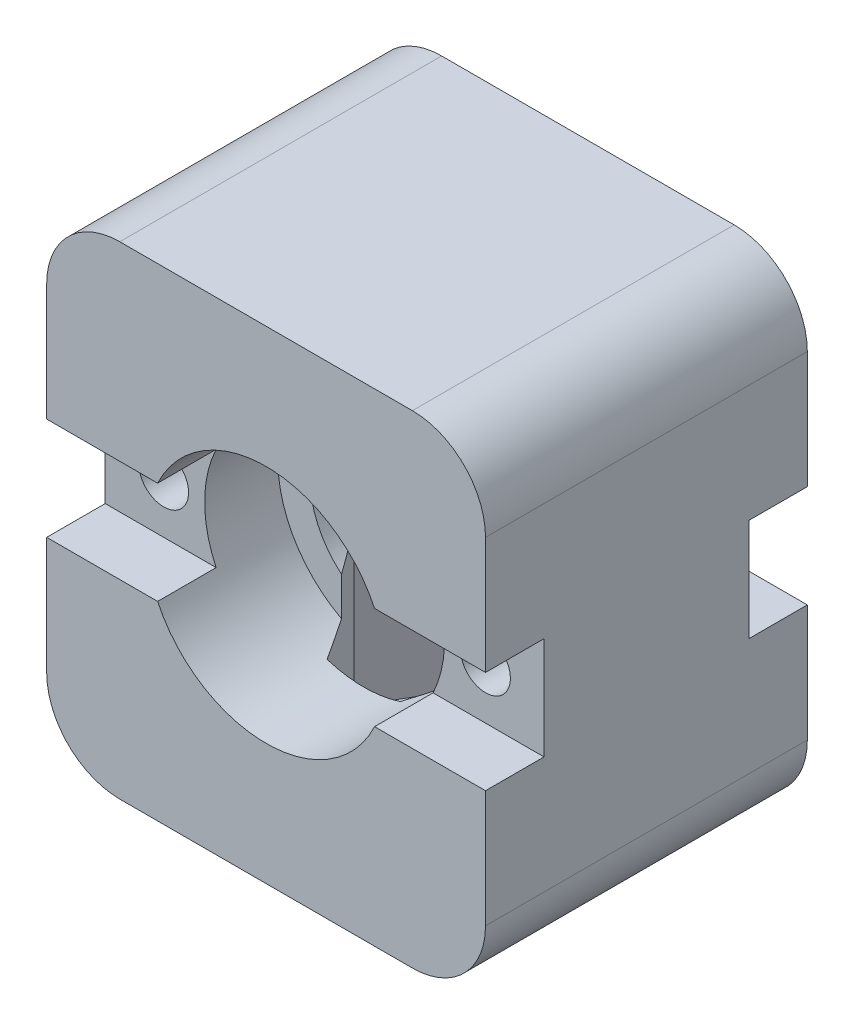
ISO-10303-21;
HEADER;
FILE_DESCRIPTION(('STEP AP214'),'2;1');
FILE_NAME('part.step','',(''),(''),'','','');
FILE_SCHEMA(('AUTOMOTIVE_DESIGN { 1 0 10303 214 1 1 1 1 }'));
ENDSEC;
DATA;
#1=APPLICATION_CONTEXT('core data for automotive mechanical design processes');
#2=APPLICATION_PROTOCOL_DEFINITION('international standard','automotive_design',2000,#1);
#3=PRODUCT_CONTEXT('',#1,'mechanical');
#4=PRODUCT('Part','Part','',(#3));
#5=PRODUCT_RELATED_PRODUCT_CATEGORY('part','',(#4));
#6=PRODUCT_DEFINITION_FORMATION('','',#4);
#7=PRODUCT_DEFINITION_CONTEXT('part definition',#1,'design');
#8=PRODUCT_DEFINITION('design','',#6,#7);
#9=PRODUCT_DEFINITION_SHAPE('','',#8);
#10=(LENGTH_UNIT() NAMED_UNIT(*) SI_UNIT(.MILLI.,.METRE.));
#11=(NAMED_UNIT(*) PLANE_ANGLE_UNIT() SI_UNIT($,.RADIAN.));
#12=(NAMED_UNIT(*) SI_UNIT($,.STERADIAN.) SOLID_ANGLE_UNIT());
#13=UNCERTAINTY_MEASURE_WITH_UNIT(LENGTH_MEASURE(1.E-05),#10,'distance_accuracy_value','');
#14=(GEOMETRIC_REPRESENTATION_CONTEXT(3) GLOBAL_UNCERTAINTY_ASSIGNED_CONTEXT((#13)) GLOBAL_UNIT_ASSIGNED_CONTEXT((#10,
#11,#12)) REPRESENTATION_CONTEXT('',''));
#15=CARTESIAN_POINT('',(0.,0.,0.));
#16=DIRECTION('',(0.,0.,1.));
#17=DIRECTION('',(1.,0.,0.));
#18=AXIS2_PLACEMENT_3D('',#15,#16,#17);
#19=CARTESIAN_POINT('',(11.,0.,22.));
#20=DIRECTION('',(0.,0.,-1.));
#21=DIRECTION('',(-1.,0.,0.));
#22=AXIS2_PLACEMENT_3D('',#19,#20,#21);
#23=CYLINDRICAL_SURFACE('',#22,1.7);
#24=CARTESIAN_POINT('',(11.,0.,7.));
#25=DIRECTION('',(0.,0.,1.));
#26=DIRECTION('',(1.,0.,0.));
#27=AXIS2_PLACEMENT_3D('',#24,#25,#26);
#28=CIRCLE('',#27,1.7);
#29=CARTESIAN_POINT('',(12.7,0.,7.));
#30=VERTEX_POINT('',#29);
#31=EDGE_CURVE('E486',#30,#30,#28,.F.);
#32=ORIENTED_EDGE('',*,*,#31,.F.);
#33=EDGE_LOOP('',(#32));
#34=FACE_BOUND('',#33,.T.);
#35=CARTESIAN_POINT('',(11.,0.,-7.));
#36=DIRECTION('',(0.,0.,-1.));
#37=DIRECTION('',(-1.,0.,0.));
#38=AXIS2_PLACEMENT_3D('',#35,#36,#37);
#39=CIRCLE('',#38,1.7);
#40=CARTESIAN_POINT('',(9.3,0.,-7.));
#41=VERTEX_POINT('',#40);
#42=EDGE_CURVE('E280',#41,#41,#39,.F.);
#43=ORIENTED_EDGE('',*,*,#42,.F.);
#44=EDGE_LOOP('',(#43));
#45=FACE_BOUND('',#44,.T.);
#46=ADVANCED_FACE('F36',(#34,#45),#23,.F.);
#47=CARTESIAN_POINT('',(-11.,0.,22.));
#48=DIRECTION('',(0.,0.,-1.));
#49=DIRECTION('',(-1.,0.,0.));
#50=AXIS2_PLACEMENT_3D('',#47,#48,#49);
#51=CYLINDRICAL_SURFACE('',#50,1.7);
#52=CARTESIAN_POINT('',(-11.,0.,7.));
#53=DIRECTION('',(0.,0.,1.));
#54=DIRECTION('',(1.,0.,0.));
#55=AXIS2_PLACEMENT_3D('',#52,#53,#54);
#56=CIRCLE('',#55,1.7);
#57=CARTESIAN_POINT('',(-9.3,0.,7.));
#58=VERTEX_POINT('',#57);
#59=EDGE_CURVE('E483',#58,#58,#56,.F.);
#60=ORIENTED_EDGE('',*,*,#59,.F.);
#61=EDGE_LOOP('',(#60));
#62=FACE_BOUND('',#61,.T.);
#63=CARTESIAN_POINT('',(-11.,0.,-7.));
#64=DIRECTION('',(0.,0.,-1.));
#65=DIRECTION('',(-1.,0.,0.));
#66=AXIS2_PLACEMENT_3D('',#63,#64,#65);
#67=CIRCLE('',#66,1.7);
#68=CARTESIAN_POINT('',(-12.7,0.,-7.));
#69=VERTEX_POINT('',#68);
#70=EDGE_CURVE('E396',#69,#69,#67,.F.);
#71=ORIENTED_EDGE('',*,*,#70,.F.);
#72=EDGE_LOOP('',(#71));
#73=FACE_BOUND('',#72,.T.);
#74=ADVANCED_FACE('F619',(#62,#73),#51,.F.);
#75=CARTESIAN_POINT('',(-15.,-11.5,-11.));
#76=DIRECTION('',(-1.,0.,0.));
#77=DIRECTION('',(0.,0.,1.));
#78=AXIS2_PLACEMENT_3D('',#75,#76,#77);
#79=PLANE('',#78);
#80=DIRECTION('',(0.,-1.,0.));
#81=VECTOR('',#80,1.);
#82=CARTESIAN_POINT('',(-15.,-11.5,-7.));
#83=LINE('',#82,#81);
#84=CARTESIAN_POINT('',(-15.,3.5,-7.));
#85=VERTEX_POINT('',#84);
#86=CARTESIAN_POINT('',(-15.,-3.5,-7.));
#87=VERTEX_POINT('',#86);
#88=EDGE_CURVE('E393',#85,#87,#83,.T.);
#89=ORIENTED_EDGE('',*,*,#88,.T.);
#90=DIRECTION('',(0.,0.,-1.));
#91=VECTOR('',#90,1.);
#92=CARTESIAN_POINT('',(-15.,-3.5,-11.));
#93=LINE('',#92,#91);
#94=CARTESIAN_POINT('',(-15.,-3.5,-11.));
#95=VERTEX_POINT('',#94);
#96=EDGE_CURVE('E405',#87,#95,#93,.T.);
#97=ORIENTED_EDGE('',*,*,#96,.T.);
#98=DIRECTION('',(0.,-1.,0.));
#99=VECTOR('',#98,1.);
#100=CARTESIAN_POINT('',(-15.,1.5,-11.));
#101=LINE('',#100,#99);
#102=CARTESIAN_POINT('',(-15.,-11.5,-11.));
#103=VERTEX_POINT('',#102);
#104=EDGE_CURVE('E303',#95,#103,#101,.T.);
#105=ORIENTED_EDGE('',*,*,#104,.T.);
#106=DIRECTION('',(0.,0.,1.));
#107=VECTOR('',#106,1.);
#108=CARTESIAN_POINT('',(-15.,-11.5,-11.));
#109=LINE('',#108,#107);
#110=CARTESIAN_POINT('',(-15.,-11.5,11.));
#111=VERTEX_POINT('',#110);
#112=EDGE_CURVE('E308',#103,#111,#109,.T.);
#113=ORIENTED_EDGE('',*,*,#112,.T.);
#114=DIRECTION('',(0.,-1.,0.));
#115=VECTOR('',#114,1.);
#116=CARTESIAN_POINT('',(-15.,1.5,11.));
#117=LINE('',#116,#115);
#118=CARTESIAN_POINT('',(-15.,-3.5,11.));
#119=VERTEX_POINT('',#118);
#120=EDGE_CURVE('E530',#119,#111,#117,.T.);
#121=ORIENTED_EDGE('',*,*,#120,.F.);
#122=DIRECTION('',(0.,0.,1.));
#123=VECTOR('',#122,1.);
#124=CARTESIAN_POINT('',(-15.,-3.5,-11.));
#125=LINE('',#124,#123);
#126=CARTESIAN_POINT('',(-15.,-3.5,7.));
#127=VERTEX_POINT('',#126);
#128=EDGE_CURVE('E497',#127,#119,#125,.T.);
#129=ORIENTED_EDGE('',*,*,#128,.F.);
#130=DIRECTION('',(0.,1.,0.));
#131=VECTOR('',#130,1.);
#132=CARTESIAN_POINT('',(-15.,-11.5,7.));
#133=LINE('',#132,#131);
#134=CARTESIAN_POINT('',(-15.,3.5,7.));
#135=VERTEX_POINT('',#134);
#136=EDGE_CURVE('E492',#127,#135,#133,.T.);
#137=ORIENTED_EDGE('',*,*,#136,.T.);
#138=DIRECTION('',(0.,0.,-1.));
#139=VECTOR('',#138,1.);
#140=CARTESIAN_POINT('',(-15.,3.5,-11.));
#141=LINE('',#140,#139);
#142=CARTESIAN_POINT('',(-15.,3.5,11.));
#143=VERTEX_POINT('',#142);
#144=EDGE_CURVE('E501',#143,#135,#141,.T.);
#145=ORIENTED_EDGE('',*,*,#144,.F.);
#146=CARTESIAN_POINT('',(-15.,11.5,11.));
#147=VERTEX_POINT('',#146);
#148=EDGE_CURVE('E531',#147,#143,#117,.T.);
#149=ORIENTED_EDGE('',*,*,#148,.F.);
#150=DIRECTION('',(0.,0.,1.));
#151=VECTOR('',#150,1.);
#152=CARTESIAN_POINT('',(-15.,11.5,-11.));
#153=LINE('',#152,#151);
#154=CARTESIAN_POINT('',(-15.,11.5,-11.));
#155=VERTEX_POINT('',#154);
#156=EDGE_CURVE('E312',#155,#147,#153,.T.);
#157=ORIENTED_EDGE('',*,*,#156,.F.);
#158=CARTESIAN_POINT('',(-15.,3.5,-11.));
#159=VERTEX_POINT('',#158);
#160=EDGE_CURVE('E304',#155,#159,#101,.T.);
#161=ORIENTED_EDGE('',*,*,#160,.T.);
#162=DIRECTION('',(0.,0.,1.));
#163=VECTOR('',#162,1.);
#164=CARTESIAN_POINT('',(-15.,3.5,-11.));
#165=LINE('',#164,#163);
#166=EDGE_CURVE('E279',#159,#85,#165,.T.);
#167=ORIENTED_EDGE('',*,*,#166,.T.);
#168=EDGE_LOOP('',(#89,#97,#105,#113,#121,#129,#137,#145,#149,#157,#161,#167));
#169=FACE_BOUND('',#168,.T.);
#170=ADVANCED_FACE('F552',(#169),#79,.T.);
#171=CARTESIAN_POINT('',(15.,1.50000000000001,-11.));
#172=DIRECTION('',(1.,0.,0.));
#173=DIRECTION('',(0.,1.,0.));
#174=AXIS2_PLACEMENT_3D('',#171,#172,#173);
#175=PLANE('',#174);
#176=DIRECTION('',(0.,1.,0.));
#177=VECTOR('',#176,1.);
#178=CARTESIAN_POINT('',(15.,-11.5,-11.));
#179=LINE('',#178,#177);
#180=CARTESIAN_POINT('',(15.,-11.5,-11.));
#181=VERTEX_POINT('',#180);
#182=CARTESIAN_POINT('',(15.,-3.5,-11.));
#183=VERTEX_POINT('',#182);
#184=EDGE_CURVE('E288',#181,#183,#179,.T.);
#185=ORIENTED_EDGE('',*,*,#184,.T.);
#186=DIRECTION('',(0.,0.,1.));
#187=VECTOR('',#186,1.);
#188=CARTESIAN_POINT('',(15.,-3.5,-11.));
#189=LINE('',#188,#187);
#190=CARTESIAN_POINT('',(15.,-3.5,-7.));
#191=VERTEX_POINT('',#190);
#192=EDGE_CURVE('E403',#183,#191,#189,.T.);
#193=ORIENTED_EDGE('',*,*,#192,.T.);
#194=DIRECTION('',(0.,1.,0.));
#195=VECTOR('',#194,1.);
#196=CARTESIAN_POINT('',(15.,1.50000000000001,-7.));
#197=LINE('',#196,#195);
#198=CARTESIAN_POINT('',(15.,3.5,-7.));
#199=VERTEX_POINT('',#198);
#200=EDGE_CURVE('E278',#191,#199,#197,.T.);
#201=ORIENTED_EDGE('',*,*,#200,.T.);
#202=DIRECTION('',(0.,0.,-1.));
#203=VECTOR('',#202,1.);
#204=CARTESIAN_POINT('',(15.,3.5,-11.));
#205=LINE('',#204,#203);
#206=CARTESIAN_POINT('',(15.,3.5,-11.));
#207=VERTEX_POINT('',#206);
#208=EDGE_CURVE('E260',#199,#207,#205,.T.);
#209=ORIENTED_EDGE('',*,*,#208,.T.);
#210=CARTESIAN_POINT('',(15.,11.5,-11.));
#211=VERTEX_POINT('',#210);
#212=EDGE_CURVE('E275',#207,#211,#179,.T.);
#213=ORIENTED_EDGE('',*,*,#212,.T.);
#214=DIRECTION('',(0.,0.,1.));
#215=VECTOR('',#214,1.);
#216=CARTESIAN_POINT('',(15.,11.5,-11.));
#217=LINE('',#216,#215);
#218=CARTESIAN_POINT('',(15.,11.5,11.));
#219=VERTEX_POINT('',#218);
#220=EDGE_CURVE('E318',#211,#219,#217,.T.);
#221=ORIENTED_EDGE('',*,*,#220,.T.);
#222=DIRECTION('',(0.,1.,0.));
#223=VECTOR('',#222,1.);
#224=CARTESIAN_POINT('',(15.,-11.5,11.));
#225=LINE('',#224,#223);
#226=CARTESIAN_POINT('',(15.,3.5,11.));
#227=VERTEX_POINT('',#226);
#228=EDGE_CURVE('E517',#227,#219,#225,.T.);
#229=ORIENTED_EDGE('',*,*,#228,.F.);
#230=DIRECTION('',(0.,0.,1.));
#231=VECTOR('',#230,1.);
#232=CARTESIAN_POINT('',(15.,3.5,-11.));
#233=LINE('',#232,#231);
#234=CARTESIAN_POINT('',(15.,3.5,7.));
#235=VERTEX_POINT('',#234);
#236=EDGE_CURVE('E499',#235,#227,#233,.T.);
#237=ORIENTED_EDGE('',*,*,#236,.F.);
#238=DIRECTION('',(0.,-1.,0.));
#239=VECTOR('',#238,1.);
#240=CARTESIAN_POINT('',(15.,1.50000000000001,7.));
#241=LINE('',#240,#239);
#242=CARTESIAN_POINT('',(15.,-3.5,7.));
#243=VERTEX_POINT('',#242);
#244=EDGE_CURVE('E489',#235,#243,#241,.T.);
#245=ORIENTED_EDGE('',*,*,#244,.T.);
#246=DIRECTION('',(0.,0.,-1.));
#247=VECTOR('',#246,1.);
#248=CARTESIAN_POINT('',(15.,-3.5,-11.));
#249=LINE('',#248,#247);
#250=CARTESIAN_POINT('',(15.,-3.5,11.));
#251=VERTEX_POINT('',#250);
#252=EDGE_CURVE('E495',#251,#243,#249,.T.);
#253=ORIENTED_EDGE('',*,*,#252,.F.);
#254=CARTESIAN_POINT('',(15.,-11.5,11.));
#255=VERTEX_POINT('',#254);
#256=EDGE_CURVE('E518',#255,#251,#225,.T.);
#257=ORIENTED_EDGE('',*,*,#256,.F.);
#258=DIRECTION('',(0.,0.,1.));
#259=VECTOR('',#258,1.);
#260=CARTESIAN_POINT('',(15.,-11.5,-11.));
#261=LINE('',#260,#259);
#262=EDGE_CURVE('E320',#181,#255,#261,.T.);
#263=ORIENTED_EDGE('',*,*,#262,.F.);
#264=EDGE_LOOP('',(#185,#193,#201,#209,#213,#221,#229,#237,#245,#253,#257,#263));
#265=FACE_BOUND('',#264,.T.);
#266=ADVANCED_FACE('F273',(#265),#175,.T.);
#267=CARTESIAN_POINT('',(-10.,-11.5,-11.));
#268=DIRECTION('',(0.,0.,1.));
#269=DIRECTION('',(1.,0.,0.));
#270=AXIS2_PLACEMENT_3D('',#267,#268,#269);
#271=PLANE('',#270);
#272=DIRECTION('',(1.,0.,0.));
#273=VECTOR('',#272,1.);
#274=CARTESIAN_POINT('',(15.3,-3.5,-11.));
#275=LINE('',#274,#273);
#276=CARTESIAN_POINT('',(7.41552425658496,-3.5,-11.));
#277=VERTEX_POINT('',#276);
#278=EDGE_CURVE('E267',#277,#183,#275,.T.);
#279=ORIENTED_EDGE('',*,*,#278,.T.);
#280=ORIENTED_EDGE('',*,*,#184,.F.);
#281=CARTESIAN_POINT('',(10.,-11.5,-11.));
#282=DIRECTION('',(0.,0.,1.));
#283=DIRECTION('',(1.,0.,0.));
#284=AXIS2_PLACEMENT_3D('',#281,#282,#283);
#285=CIRCLE('',#284,5.);
#286=CARTESIAN_POINT('',(9.99999999999996,-16.5,-11.));
#287=VERTEX_POINT('',#286);
#288=EDGE_CURVE('E289',#287,#181,#285,.T.);
#289=ORIENTED_EDGE('',*,*,#288,.F.);
#290=DIRECTION('',(1.,0.,0.));
#291=VECTOR('',#290,1.);
#292=CARTESIAN_POINT('',(9.99999999999996,-16.5,-11.));
#293=LINE('',#292,#291);
#294=CARTESIAN_POINT('',(-9.99999999999996,-16.5,-11.));
#295=VERTEX_POINT('',#294);
#296=EDGE_CURVE('E292',#295,#287,#293,.T.);
#297=ORIENTED_EDGE('',*,*,#296,.F.);
#298=CARTESIAN_POINT('',(-10.,-11.5,-11.));
#299=DIRECTION('',(0.,0.,1.));
#300=DIRECTION('',(1.,0.,0.));
#301=AXIS2_PLACEMENT_3D('',#298,#299,#300);
#302=CIRCLE('',#301,5.);
#303=EDGE_CURVE('E534',#103,#295,#302,.T.);
#304=ORIENTED_EDGE('',*,*,#303,.F.);
#305=ORIENTED_EDGE('',*,*,#104,.F.);
#306=CARTESIAN_POINT('',(-7.41552425658496,-3.5,-11.));
#307=VERTEX_POINT('',#306);
#308=EDGE_CURVE('E388',#95,#307,#275,.T.);
#309=ORIENTED_EDGE('',*,*,#308,.T.);
#310=CARTESIAN_POINT('',(0.,0.,-11.));
#311=DIRECTION('',(0.,0.,1.));
#312=DIRECTION('',(1.,0.,0.));
#313=AXIS2_PLACEMENT_3D('',#310,#311,#312);
#314=CIRCLE('',#313,8.2);
#315=EDGE_CURVE('E408',#307,#277,#314,.T.);
#316=ORIENTED_EDGE('',*,*,#315,.T.);
#317=EDGE_LOOP('',(#279,#280,#289,#297,#304,#305,#309,#316));
#318=FACE_BOUND('',#317,.T.);
#319=ADVANCED_FACE('F544',(#318),#271,.F.);
#320=DIRECTION('',(-1.,0.,0.));
#321=VECTOR('',#320,1.);
#322=CARTESIAN_POINT('',(15.3,3.5,-11.));
#323=LINE('',#322,#321);
#324=CARTESIAN_POINT('',(-7.41552425658496,3.5,-11.));
#325=VERTEX_POINT('',#324);
#326=EDGE_CURVE('E268',#325,#159,#323,.T.);
#327=ORIENTED_EDGE('',*,*,#326,.T.);
#328=ORIENTED_EDGE('',*,*,#160,.F.);
#329=CARTESIAN_POINT('',(-10.,11.5,-11.));
#330=DIRECTION('',(0.,0.,1.));
#331=DIRECTION('',(-1.,0.,0.));
#332=AXIS2_PLACEMENT_3D('',#329,#330,#331);
#333=CIRCLE('',#332,5.);
#334=CARTESIAN_POINT('',(-9.99999999999996,16.5,-11.));
#335=VERTEX_POINT('',#334);
#336=EDGE_CURVE('E300',#335,#155,#333,.T.);
#337=ORIENTED_EDGE('',*,*,#336,.F.);
#338=DIRECTION('',(-1.,0.,0.));
#339=VECTOR('',#338,1.);
#340=CARTESIAN_POINT('',(9.99999999999996,16.5,-11.));
#341=LINE('',#340,#339);
#342=CARTESIAN_POINT('',(9.99999999999996,16.5,-11.));
#343=VERTEX_POINT('',#342);
#344=EDGE_CURVE('E297',#343,#335,#341,.T.);
#345=ORIENTED_EDGE('',*,*,#344,.F.);
#346=CARTESIAN_POINT('',(10.,11.5,-11.));
#347=DIRECTION('',(0.,0.,1.));
#348=DIRECTION('',(1.,0.,0.));
#349=AXIS2_PLACEMENT_3D('',#346,#347,#348);
#350=CIRCLE('',#349,5.);
#351=EDGE_CURVE('E287',#211,#343,#350,.T.);
#352=ORIENTED_EDGE('',*,*,#351,.F.);
#353=ORIENTED_EDGE('',*,*,#212,.F.);
#354=CARTESIAN_POINT('',(7.41552425658496,3.5,-11.));
#355=VERTEX_POINT('',#354);
#356=EDGE_CURVE('E256',#207,#355,#323,.T.);
#357=ORIENTED_EDGE('',*,*,#356,.T.);
#358=EDGE_CURVE('E413',#355,#325,#314,.T.);
#359=ORIENTED_EDGE('',*,*,#358,.T.);
#360=EDGE_LOOP('',(#327,#328,#337,#345,#352,#353,#357,#359));
#361=FACE_BOUND('',#360,.T.);
#362=ADVANCED_FACE('F284',(#361),#271,.F.);
#363=CARTESIAN_POINT('',(0.,0.,-2.));
#364=DIRECTION('',(0.,0.,-1.));
#365=DIRECTION('',(-1.,0.,0.));
#366=AXIS2_PLACEMENT_3D('',#363,#364,#365);
#367=CYLINDRICAL_SURFACE('',#366,8.2);
#368=CARTESIAN_POINT('',(0.,0.,-8.66025403784439));
#369=DIRECTION('',(-0.866025403784439,0.,-0.5));
#370=DIRECTION('',(0.5,0.,-0.866025403784439));
#371=AXIS2_PLACEMENT_3D('',#368,#369,#370);
#372=ELLIPSE('',#371,16.4,8.2);
#373=CARTESIAN_POINT('',(-3.84529946162075,-7.24249073526913,-2.));
#374=VERTEX_POINT('',#373);
#375=CARTESIAN_POINT('',(-2.5,-7.80960946526777,-4.3301270189222));
#376=VERTEX_POINT('',#375);
#377=EDGE_CURVE('E420',#374,#376,#372,.F.);
#378=ORIENTED_EDGE('',*,*,#377,.T.);
#379=CARTESIAN_POINT('',(0.,0.,-4.3301270189222));
#380=DIRECTION('',(0.,0.,-1.));
#381=DIRECTION('',(-1.,0.,0.));
#382=AXIS2_PLACEMENT_3D('',#379,#380,#381);
#383=CIRCLE('',#382,8.2);
#384=CARTESIAN_POINT('',(2.5,-7.80960946526778,-4.3301270189222));
#385=VERTEX_POINT('',#384);
#386=EDGE_CURVE('E418',#376,#385,#383,.F.);
#387=ORIENTED_EDGE('',*,*,#386,.T.);
#388=CARTESIAN_POINT('',(0.,0.,-8.66025403784439));
#389=DIRECTION('',(0.866025403784439,0.,-0.5));
#390=DIRECTION('',(-0.5,0.,-0.866025403784439));
#391=AXIS2_PLACEMENT_3D('',#388,#389,#390);
#392=ELLIPSE('',#391,16.4,8.2);
#393=CARTESIAN_POINT('',(3.84529946162075,-7.24249073526913,-2.));
#394=VERTEX_POINT('',#393);
#395=EDGE_CURVE('E365',#385,#394,#392,.F.);
#396=ORIENTED_EDGE('',*,*,#395,.T.);
#397=CARTESIAN_POINT('',(0.,0.,-2.));
#398=DIRECTION('',(0.,0.,1.));
#399=DIRECTION('',(1.,0.,0.));
#400=AXIS2_PLACEMENT_3D('',#397,#398,#399);
#401=CIRCLE('',#400,8.2);
#402=EDGE_CURVE('E409',#394,#374,#401,.T.);
#403=ORIENTED_EDGE('',*,*,#402,.T.);
#404=EDGE_LOOP('',(#378,#387,#396,#403));
#405=FACE_BOUND('',#404,.T.);
#406=CARTESIAN_POINT('',(0.,0.,-7.));
#407=DIRECTION('',(0.,0.,-1.));
#408=DIRECTION('',(-1.,0.,0.));
#409=AXIS2_PLACEMENT_3D('',#406,#407,#408);
#410=CIRCLE('',#409,8.2);
#411=CARTESIAN_POINT('',(7.41552425658496,3.5,-7.));
#412=VERTEX_POINT('',#411);
#413=CARTESIAN_POINT('',(7.41552425658496,-3.5,-7.));
#414=VERTEX_POINT('',#413);
#415=EDGE_CURVE('E372',#412,#414,#410,.T.);
#416=ORIENTED_EDGE('',*,*,#415,.T.);
#417=DIRECTION('',(0.,0.,-1.));
#418=VECTOR('',#417,1.);
#419=CARTESIAN_POINT('',(7.41552425658496,-3.5,-2.));
#420=LINE('',#419,#418);
#421=EDGE_CURVE('E11',#414,#277,#420,.T.);
#422=ORIENTED_EDGE('',*,*,#421,.T.);
#423=ORIENTED_EDGE('',*,*,#315,.F.);
#424=DIRECTION('',(0.,0.,-1.));
#425=VECTOR('',#424,1.);
#426=CARTESIAN_POINT('',(-7.41552425658496,-3.5,-2.));
#427=LINE('',#426,#425);
#428=CARTESIAN_POINT('',(-7.41552425658496,-3.5,-7.));
#429=VERTEX_POINT('',#428);
#430=EDGE_CURVE('E375',#307,#429,#427,.F.);
#431=ORIENTED_EDGE('',*,*,#430,.T.);
#432=CARTESIAN_POINT('',(-7.41552425658496,3.5,-7.));
#433=VERTEX_POINT('',#432);
#434=EDGE_CURVE('E368',#429,#433,#410,.T.);
#435=ORIENTED_EDGE('',*,*,#434,.T.);
#436=DIRECTION('',(0.,0.,-1.));
#437=VECTOR('',#436,1.);
#438=CARTESIAN_POINT('',(-7.41552425658496,3.5,-2.));
#439=LINE('',#438,#437);
#440=EDGE_CURVE('E371',#433,#325,#439,.T.);
#441=ORIENTED_EDGE('',*,*,#440,.T.);
#442=ORIENTED_EDGE('',*,*,#358,.F.);
#443=DIRECTION('',(0.,0.,-1.));
#444=VECTOR('',#443,1.);
#445=CARTESIAN_POINT('',(7.41552425658496,3.5,-2.));
#446=LINE('',#445,#444);
#447=EDGE_CURVE('E44',#355,#412,#446,.F.);
#448=ORIENTED_EDGE('',*,*,#447,.T.);
#449=EDGE_LOOP('',(#416,#422,#423,#431,#435,#441,#442,#448));
#450=FACE_BOUND('',#449,.T.);
#451=ADVANCED_FACE('F379',(#405,#450),#367,.F.);
#452=CARTESIAN_POINT('',(0.,0.,22.));
#453=DIRECTION('',(0.,0.,-1.));
#454=DIRECTION('',(-1.,0.,0.));
#455=AXIS2_PLACEMENT_3D('',#452,#453,#454);
#456=CYLINDRICAL_SURFACE('',#455,6.);
#457=CARTESIAN_POINT('',(0.,0.,-2.));
#458=DIRECTION('',(0.,0.,-1.));
#459=DIRECTION('',(-1.,0.,0.));
#460=AXIS2_PLACEMENT_3D('',#457,#458,#459);
#461=CIRCLE('',#460,6.);
#462=CARTESIAN_POINT('',(3.84529946162075,-4.60583022379888,-2.));
#463=VERTEX_POINT('',#462);
#464=CARTESIAN_POINT('',(-3.84529946162075,-4.60583022379887,-2.));
#465=VERTEX_POINT('',#464);
#466=EDGE_CURVE('E412',#463,#465,#461,.F.);
#467=ORIENTED_EDGE('',*,*,#466,.F.);
#468=CARTESIAN_POINT('',(0.,0.,-8.66025403784438));
#469=DIRECTION('',(0.866025403784439,0.,-0.5));
#470=DIRECTION('',(-0.5,0.,-0.866025403784439));
#471=AXIS2_PLACEMENT_3D('',#468,#469,#470);
#472=ELLIPSE('',#471,12.,6.);
#473=CARTESIAN_POINT('',(5.,-3.31662479035541,0.));
#474=VERTEX_POINT('',#473);
#475=EDGE_CURVE('E353',#463,#474,#472,.F.);
#476=ORIENTED_EDGE('',*,*,#475,.T.);
#477=CARTESIAN_POINT('',(0.,0.,8.66025403784439));
#478=DIRECTION('',(0.866025403784439,0.,0.5));
#479=DIRECTION('',(0.5,0.,-0.866025403784439));
#480=AXIS2_PLACEMENT_3D('',#477,#478,#479);
#481=ELLIPSE('',#480,12.,6.);
#482=CARTESIAN_POINT('',(3.84529946162075,-4.60583022379887,2.));
#483=VERTEX_POINT('',#482);
#484=EDGE_CURVE('E466',#474,#483,#481,.F.);
#485=ORIENTED_EDGE('',*,*,#484,.T.);
#486=CARTESIAN_POINT('',(0.,0.,2.));
#487=DIRECTION('',(0.,0.,1.));
#488=DIRECTION('',(1.,0.,0.));
#489=AXIS2_PLACEMENT_3D('',#486,#487,#488);
#490=CIRCLE('',#489,6.);
#491=CARTESIAN_POINT('',(-3.84529946162075,-4.60583022379887,2.));
#492=VERTEX_POINT('',#491);
#493=EDGE_CURVE('E325',#492,#483,#490,.F.);
#494=ORIENTED_EDGE('',*,*,#493,.F.);
#495=CARTESIAN_POINT('',(0.,0.,8.6602540378444));
#496=DIRECTION('',(-0.866025403784439,0.,0.5));
#497=DIRECTION('',(-0.5,0.,-0.866025403784439));
#498=AXIS2_PLACEMENT_3D('',#495,#496,#497);
#499=ELLIPSE('',#498,12.,6.);
#500=CARTESIAN_POINT('',(-5.,-3.31662479035539,0.));
#501=VERTEX_POINT('',#500);
#502=EDGE_CURVE('E461',#492,#501,#499,.F.);
#503=ORIENTED_EDGE('',*,*,#502,.T.);
#504=CARTESIAN_POINT('',(0.,0.,-8.6602540378444));
#505=DIRECTION('',(-0.866025403784439,0.,-0.5));
#506=DIRECTION('',(0.5,0.,-0.866025403784439));
#507=AXIS2_PLACEMENT_3D('',#504,#505,#506);
#508=ELLIPSE('',#507,12.,6.);
#509=EDGE_CURVE('E355',#501,#465,#508,.F.);
#510=ORIENTED_EDGE('',*,*,#509,.T.);
#511=EDGE_LOOP('',(#467,#476,#485,#494,#503,#510));
#512=FACE_BOUND('',#511,.T.);
#513=ADVANCED_FACE('F632',(#512),#456,.F.);
#514=CARTESIAN_POINT('',(-2.5,-14.,-4.3301270189222));
#515=DIRECTION('',(-0.866025403784439,0.,-0.5));
#516=DIRECTION('',(-0.5,0.,0.866025403784439));
#517=AXIS2_PLACEMENT_3D('',#514,#515,#516);
#518=PLANE('',#517);
#519=ORIENTED_EDGE('',*,*,#377,.F.);
#520=DIRECTION('',(0.,-1.,0.));
#521=VECTOR('',#520,1.);
#522=CARTESIAN_POINT('',(-3.84529946162075,-14.,-2.));
#523=LINE('',#522,#521);
#524=EDGE_CURVE('E416',#465,#374,#523,.T.);
#525=ORIENTED_EDGE('',*,*,#524,.F.);
#526=ORIENTED_EDGE('',*,*,#509,.F.);
#527=DIRECTION('',(0.,1.,0.));
#528=VECTOR('',#527,1.);
#529=CARTESIAN_POINT('',(-5.,-14.,0.));
#530=LINE('',#529,#528);
#531=CARTESIAN_POINT('',(-5.,-14.,0.));
#532=VERTEX_POINT('',#531);
#533=EDGE_CURVE('E449',#532,#501,#530,.T.);
#534=ORIENTED_EDGE('',*,*,#533,.F.);
#535=DIRECTION('',(-0.5,0.,0.866025403784439));
#536=VECTOR('',#535,1.);
#537=CARTESIAN_POINT('',(-2.5,-14.,-4.3301270189222));
#538=LINE('',#537,#536);
#539=CARTESIAN_POINT('',(-2.5,-14.,-4.3301270189222));
#540=VERTEX_POINT('',#539);
#541=EDGE_CURVE('E432',#540,#532,#538,.T.);
#542=ORIENTED_EDGE('',*,*,#541,.F.);
#543=DIRECTION('',(0.,1.,0.));
#544=VECTOR('',#543,1.);
#545=CARTESIAN_POINT('',(-2.5,-14.,-4.3301270189222));
#546=LINE('',#545,#544);
#547=EDGE_CURVE('E452',#540,#376,#546,.T.);
#548=ORIENTED_EDGE('',*,*,#547,.T.);
#549=EDGE_LOOP('',(#519,#525,#526,#534,#542,#548));
#550=FACE_BOUND('',#549,.T.);
#551=ADVANCED_FACE('F635',(#550),#518,.F.);
#552=CARTESIAN_POINT('',(5.,-14.,0.));
#553=DIRECTION('',(0.866025403784439,0.,-0.5));
#554=DIRECTION('',(-0.5,0.,-0.866025403784439));
#555=AXIS2_PLACEMENT_3D('',#552,#553,#554);
#556=PLANE('',#555);
#557=ORIENTED_EDGE('',*,*,#395,.F.);
#558=DIRECTION('',(0.,1.,0.));
#559=VECTOR('',#558,1.);
#560=CARTESIAN_POINT('',(2.5,-14.,-4.3301270189222));
#561=LINE('',#560,#559);
#562=CARTESIAN_POINT('',(2.5,-14.,-4.3301270189222));
#563=VERTEX_POINT('',#562);
#564=EDGE_CURVE('E455',#563,#385,#561,.T.);
#565=ORIENTED_EDGE('',*,*,#564,.F.);
#566=DIRECTION('',(-0.5,0.,-0.866025403784439));
#567=VECTOR('',#566,1.);
#568=CARTESIAN_POINT('',(5.,-14.,0.));
#569=LINE('',#568,#567);
#570=CARTESIAN_POINT('',(5.,-14.,0.));
#571=VERTEX_POINT('',#570);
#572=EDGE_CURVE('E426',#571,#563,#569,.T.);
#573=ORIENTED_EDGE('',*,*,#572,.F.);
#574=DIRECTION('',(0.,1.,0.));
#575=VECTOR('',#574,1.);
#576=CARTESIAN_POINT('',(5.,-14.,0.));
#577=LINE('',#576,#575);
#578=EDGE_CURVE('E441',#571,#474,#577,.T.);
#579=ORIENTED_EDGE('',*,*,#578,.T.);
#580=ORIENTED_EDGE('',*,*,#475,.F.);
#581=DIRECTION('',(0.,1.,0.));
#582=VECTOR('',#581,1.);
#583=CARTESIAN_POINT('',(3.84529946162075,-14.,-2.));
#584=LINE('',#583,#582);
#585=EDGE_CURVE('E358',#394,#463,#584,.T.);
#586=ORIENTED_EDGE('',*,*,#585,.F.);
#587=EDGE_LOOP('',(#557,#565,#573,#579,#580,#586));
#588=FACE_BOUND('',#587,.T.);
#589=ADVANCED_FACE('F686',(#588),#556,.F.);
#590=CARTESIAN_POINT('',(-10.,-11.5,11.));
#591=DIRECTION('',(0.,0.,1.));
#592=DIRECTION('',(1.,0.,0.));
#593=AXIS2_PLACEMENT_3D('',#590,#591,#592);
#594=PLANE('',#593);
#595=DIRECTION('',(-1.,0.,0.));
#596=VECTOR('',#595,1.);
#597=CARTESIAN_POINT('',(15.3,3.5,11.));
#598=LINE('',#597,#596);
#599=CARTESIAN_POINT('',(7.41552425658496,3.5,11.));
#600=VERTEX_POINT('',#599);
#601=EDGE_CURVE('E474',#227,#600,#598,.T.);
#602=ORIENTED_EDGE('',*,*,#601,.F.);
#603=ORIENTED_EDGE('',*,*,#228,.T.);
#604=CARTESIAN_POINT('',(10.,11.5,11.));
#605=DIRECTION('',(0.,0.,1.));
#606=DIRECTION('',(1.,0.,0.));
#607=AXIS2_PLACEMENT_3D('',#604,#605,#606);
#608=CIRCLE('',#607,5.);
#609=CARTESIAN_POINT('',(9.99999999999996,16.5,11.));
#610=VERTEX_POINT('',#609);
#611=EDGE_CURVE('E521',#219,#610,#608,.T.);
#612=ORIENTED_EDGE('',*,*,#611,.T.);
#613=DIRECTION('',(-1.,0.,0.));
#614=VECTOR('',#613,1.);
#615=CARTESIAN_POINT('',(9.99999999999996,16.5,11.));
#616=LINE('',#615,#614);
#617=CARTESIAN_POINT('',(-9.99999999999996,16.5,11.));
#618=VERTEX_POINT('',#617);
#619=EDGE_CURVE('E524',#610,#618,#616,.T.);
#620=ORIENTED_EDGE('',*,*,#619,.T.);
#621=CARTESIAN_POINT('',(-10.,11.5,11.));
#622=DIRECTION('',(0.,0.,1.));
#623=DIRECTION('',(-1.,0.,0.));
#624=AXIS2_PLACEMENT_3D('',#621,#622,#623);
#625=CIRCLE('',#624,5.);
#626=EDGE_CURVE('E527',#618,#147,#625,.T.);
#627=ORIENTED_EDGE('',*,*,#626,.T.);
#628=ORIENTED_EDGE('',*,*,#148,.T.);
#629=CARTESIAN_POINT('',(-7.41552425658496,3.5,11.));
#630=VERTEX_POINT('',#629);
#631=EDGE_CURVE('E481',#630,#143,#598,.T.);
#632=ORIENTED_EDGE('',*,*,#631,.F.);
#633=CARTESIAN_POINT('',(0.,0.,11.));
#634=DIRECTION('',(0.,0.,1.));
#635=DIRECTION('',(1.,0.,0.));
#636=AXIS2_PLACEMENT_3D('',#633,#634,#635);
#637=CIRCLE('',#636,8.2);
#638=EDGE_CURVE('E506',#600,#630,#637,.T.);
#639=ORIENTED_EDGE('',*,*,#638,.F.);
#640=EDGE_LOOP('',(#602,#603,#612,#620,#627,#628,#632,#639));
#641=FACE_BOUND('',#640,.T.);
#642=ADVANCED_FACE('F573',(#641),#594,.T.);
#643=CARTESIAN_POINT('',(-10.,-11.5,-11.));
#644=DIRECTION('',(0.,0.,1.));
#645=DIRECTION('',(1.,0.,0.));
#646=AXIS2_PLACEMENT_3D('',#643,#644,#645);
#647=CYLINDRICAL_SURFACE('',#646,5.);
#648=DIRECTION('',(0.,0.,1.));
#649=VECTOR('',#648,1.);
#650=CARTESIAN_POINT('',(-9.99999999999996,-16.5,-11.));
#651=LINE('',#650,#649);
#652=CARTESIAN_POINT('',(-9.99999999999996,-16.5,11.));
#653=VERTEX_POINT('',#652);
#654=EDGE_CURVE('E307',#295,#653,#651,.T.);
#655=ORIENTED_EDGE('',*,*,#654,.T.);
#656=CARTESIAN_POINT('',(-10.,-11.5,11.));
#657=DIRECTION('',(0.,0.,1.));
#658=DIRECTION('',(1.,0.,0.));
#659=AXIS2_PLACEMENT_3D('',#656,#657,#658);
#660=CIRCLE('',#659,5.);
#661=EDGE_CURVE('E328',#111,#653,#660,.T.);
#662=ORIENTED_EDGE('',*,*,#661,.F.);
#663=ORIENTED_EDGE('',*,*,#112,.F.);
#664=ORIENTED_EDGE('',*,*,#303,.T.);
#665=EDGE_LOOP('',(#655,#662,#663,#664));
#666=FACE_BOUND('',#665,.T.);
#667=ADVANCED_FACE('F38',(#666),#647,.T.);
#668=CARTESIAN_POINT('',(-10.,11.5,-11.));
#669=DIRECTION('',(0.,0.,1.));
#670=DIRECTION('',(1.,0.,0.));
#671=AXIS2_PLACEMENT_3D('',#668,#669,#670);
#672=CYLINDRICAL_SURFACE('',#671,5.);
#673=ORIENTED_EDGE('',*,*,#156,.T.);
#674=ORIENTED_EDGE('',*,*,#626,.F.);
#675=DIRECTION('',(0.,0.,1.));
#676=VECTOR('',#675,1.);
#677=CARTESIAN_POINT('',(-9.99999999999996,16.5,-11.));
#678=LINE('',#677,#676);
#679=EDGE_CURVE('E314',#335,#618,#678,.T.);
#680=ORIENTED_EDGE('',*,*,#679,.F.);
#681=ORIENTED_EDGE('',*,*,#336,.T.);
#682=EDGE_LOOP('',(#673,#674,#680,#681));
#683=FACE_BOUND('',#682,.T.);
#684=ADVANCED_FACE('F566',(#683),#672,.T.);
#685=CARTESIAN_POINT('',(9.99999999999996,16.5,-11.));
#686=DIRECTION('',(0.,1.,0.));
#687=DIRECTION('',(0.,0.,1.));
#688=AXIS2_PLACEMENT_3D('',#685,#686,#687);
#689=PLANE('',#688);
#690=ORIENTED_EDGE('',*,*,#679,.T.);
#691=ORIENTED_EDGE('',*,*,#619,.F.);
#692=DIRECTION('',(0.,0.,1.));
#693=VECTOR('',#692,1.);
#694=CARTESIAN_POINT('',(9.99999999999996,16.5,-11.));
#695=LINE('',#694,#693);
#696=EDGE_CURVE('E316',#343,#610,#695,.T.);
#697=ORIENTED_EDGE('',*,*,#696,.F.);
#698=ORIENTED_EDGE('',*,*,#344,.T.);
#699=EDGE_LOOP('',(#690,#691,#697,#698));
#700=FACE_BOUND('',#699,.T.);
#701=ADVANCED_FACE('F570',(#700),#689,.T.);
#702=CARTESIAN_POINT('',(10.,11.5,-11.));
#703=DIRECTION('',(0.,0.,1.));
#704=DIRECTION('',(1.,0.,0.));
#705=AXIS2_PLACEMENT_3D('',#702,#703,#704);
#706=CYLINDRICAL_SURFACE('',#705,5.);
#707=ORIENTED_EDGE('',*,*,#696,.T.);
#708=ORIENTED_EDGE('',*,*,#611,.F.);
#709=ORIENTED_EDGE('',*,*,#220,.F.);
#710=ORIENTED_EDGE('',*,*,#351,.T.);
#711=EDGE_LOOP('',(#707,#708,#709,#710));
#712=FACE_BOUND('',#711,.T.);
#713=ADVANCED_FACE('F578',(#712),#706,.T.);
#714=CARTESIAN_POINT('',(10.,-11.5,-11.));
#715=DIRECTION('',(0.,0.,1.));
#716=DIRECTION('',(1.,0.,0.));
#717=AXIS2_PLACEMENT_3D('',#714,#715,#716);
#718=CYLINDRICAL_SURFACE('',#717,5.);
#719=ORIENTED_EDGE('',*,*,#262,.T.);
#720=CARTESIAN_POINT('',(10.,-11.5,11.));
#721=DIRECTION('',(0.,0.,1.));
#722=DIRECTION('',(1.,0.,0.));
#723=AXIS2_PLACEMENT_3D('',#720,#721,#722);
#724=CIRCLE('',#723,5.);
#725=CARTESIAN_POINT('',(9.99999999999996,-16.5,11.));
#726=VERTEX_POINT('',#725);
#727=EDGE_CURVE('E514',#726,#255,#724,.T.);
#728=ORIENTED_EDGE('',*,*,#727,.F.);
#729=DIRECTION('',(0.,0.,1.));
#730=VECTOR('',#729,1.);
#731=CARTESIAN_POINT('',(9.99999999999996,-16.5,-11.));
#732=LINE('',#731,#730);
#733=EDGE_CURVE('E322',#287,#726,#732,.T.);
#734=ORIENTED_EDGE('',*,*,#733,.F.);
#735=ORIENTED_EDGE('',*,*,#288,.T.);
#736=EDGE_LOOP('',(#719,#728,#734,#735));
#737=FACE_BOUND('',#736,.T.);
#738=ADVANCED_FACE('F607',(#737),#718,.T.);
#739=CARTESIAN_POINT('',(9.99999999999996,-16.5,-11.));
#740=DIRECTION('',(0.,-1.,0.));
#741=DIRECTION('',(1.,0.,0.));
#742=AXIS2_PLACEMENT_3D('',#739,#740,#741);
#743=PLANE('',#742);
#744=CARTESIAN_POINT('',(0.,-16.5,0.));
#745=DIRECTION('',(0.,-1.,0.));
#746=DIRECTION('',(1.,0.,0.));
#747=AXIS2_PLACEMENT_3D('',#744,#745,#746);
#748=CIRCLE('',#747,2.6);
#749=CARTESIAN_POINT('',(2.6,-16.5,0.));
#750=VERTEX_POINT('',#749);
#751=EDGE_CURVE('E363',#750,#750,#748,.T.);
#752=ORIENTED_EDGE('',*,*,#751,.F.);
#753=EDGE_LOOP('',(#752));
#754=FACE_BOUND('',#753,.T.);
#755=ORIENTED_EDGE('',*,*,#733,.T.);
#756=DIRECTION('',(1.,0.,0.));
#757=VECTOR('',#756,1.);
#758=CARTESIAN_POINT('',(9.99999999999996,-16.5,11.));
#759=LINE('',#758,#757);
#760=EDGE_CURVE('E511',#653,#726,#759,.T.);
#761=ORIENTED_EDGE('',*,*,#760,.F.);
#762=ORIENTED_EDGE('',*,*,#654,.F.);
#763=ORIENTED_EDGE('',*,*,#296,.T.);
#764=EDGE_LOOP('',(#755,#761,#762,#763));
#765=FACE_BOUND('',#764,.T.);
#766=ADVANCED_FACE('F539',(#754,#765),#743,.T.);
#767=DIRECTION('',(1.,0.,0.));
#768=VECTOR('',#767,1.);
#769=CARTESIAN_POINT('',(15.3,-3.5,11.));
#770=LINE('',#769,#768);
#771=CARTESIAN_POINT('',(-7.41552425658496,-3.5,11.));
#772=VERTEX_POINT('',#771);
#773=EDGE_CURVE('E480',#119,#772,#770,.T.);
#774=ORIENTED_EDGE('',*,*,#773,.F.);
#775=ORIENTED_EDGE('',*,*,#120,.T.);
#776=ORIENTED_EDGE('',*,*,#661,.T.);
#777=ORIENTED_EDGE('',*,*,#760,.T.);
#778=ORIENTED_EDGE('',*,*,#727,.T.);
#779=ORIENTED_EDGE('',*,*,#256,.T.);
#780=CARTESIAN_POINT('',(7.41552425658496,-3.5,11.));
#781=VERTEX_POINT('',#780);
#782=EDGE_CURVE('E469',#781,#251,#770,.T.);
#783=ORIENTED_EDGE('',*,*,#782,.F.);
#784=EDGE_CURVE('E503',#772,#781,#637,.T.);
#785=ORIENTED_EDGE('',*,*,#784,.F.);
#786=EDGE_LOOP('',(#774,#775,#776,#777,#778,#779,#783,#785));
#787=FACE_BOUND('',#786,.T.);
#788=ADVANCED_FACE('F603',(#787),#594,.T.);
#789=CARTESIAN_POINT('',(0.,0.,2.));
#790=DIRECTION('',(0.,0.,1.));
#791=DIRECTION('',(1.,0.,0.));
#792=AXIS2_PLACEMENT_3D('',#789,#790,#791);
#793=PLANE('',#792);
#794=DIRECTION('',(0.,1.,0.));
#795=VECTOR('',#794,1.);
#796=CARTESIAN_POINT('',(3.84529946162075,0.,2.));
#797=LINE('',#796,#795);
#798=CARTESIAN_POINT('',(3.84529946162075,-7.24249073526913,2.));
#799=VERTEX_POINT('',#798);
#800=EDGE_CURVE('E464',#799,#483,#797,.T.);
#801=ORIENTED_EDGE('',*,*,#800,.F.);
#802=CARTESIAN_POINT('',(0.,0.,2.));
#803=DIRECTION('',(0.,0.,1.));
#804=DIRECTION('',(1.,0.,0.));
#805=AXIS2_PLACEMENT_3D('',#802,#803,#804);
#806=CIRCLE('',#805,8.2);
#807=CARTESIAN_POINT('',(-3.84529946162075,-7.24249073526913,2.));
#808=VERTEX_POINT('',#807);
#809=EDGE_CURVE('E329',#799,#808,#806,.T.);
#810=ORIENTED_EDGE('',*,*,#809,.T.);
#811=DIRECTION('',(0.,-1.,0.));
#812=VECTOR('',#811,1.);
#813=CARTESIAN_POINT('',(-3.84529946162075,0.,2.));
#814=LINE('',#813,#812);
#815=EDGE_CURVE('E445',#492,#808,#814,.T.);
#816=ORIENTED_EDGE('',*,*,#815,.F.);
#817=ORIENTED_EDGE('',*,*,#493,.T.);
#818=EDGE_LOOP('',(#801,#810,#816,#817));
#819=FACE_BOUND('',#818,.T.);
#820=ADVANCED_FACE('F639',(#819),#793,.T.);
#821=CARTESIAN_POINT('',(0.,0.,2.));
#822=DIRECTION('',(0.,0.,1.));
#823=DIRECTION('',(1.,0.,0.));
#824=AXIS2_PLACEMENT_3D('',#821,#822,#823);
#825=CYLINDRICAL_SURFACE('',#824,8.2);
#826=ORIENTED_EDGE('',*,*,#638,.T.);
#827=DIRECTION('',(0.,0.,1.));
#828=VECTOR('',#827,1.);
#829=CARTESIAN_POINT('',(-7.41552425658496,3.5,2.));
#830=LINE('',#829,#828);
#831=CARTESIAN_POINT('',(-7.41552425658496,3.5,7.));
#832=VERTEX_POINT('',#831);
#833=EDGE_CURVE('E341',#630,#832,#830,.F.);
#834=ORIENTED_EDGE('',*,*,#833,.T.);
#835=CARTESIAN_POINT('',(0.,0.,7.));
#836=DIRECTION('',(0.,0.,1.));
#837=DIRECTION('',(1.,0.,0.));
#838=AXIS2_PLACEMENT_3D('',#835,#836,#837);
#839=CIRCLE('',#838,8.2);
#840=CARTESIAN_POINT('',(-7.41552425658496,-3.5,7.));
#841=VERTEX_POINT('',#840);
#842=EDGE_CURVE('E332',#841,#832,#839,.F.);
#843=ORIENTED_EDGE('',*,*,#842,.F.);
#844=DIRECTION('',(0.,0.,1.));
#845=VECTOR('',#844,1.);
#846=CARTESIAN_POINT('',(-7.41552425658496,-3.5,2.));
#847=LINE('',#846,#845);
#848=EDGE_CURVE('E338',#841,#772,#847,.T.);
#849=ORIENTED_EDGE('',*,*,#848,.T.);
#850=ORIENTED_EDGE('',*,*,#784,.T.);
#851=DIRECTION('',(0.,0.,1.));
#852=VECTOR('',#851,1.);
#853=CARTESIAN_POINT('',(7.41552425658496,-3.5,2.));
#854=LINE('',#853,#852);
#855=CARTESIAN_POINT('',(7.41552425658496,-3.5,7.));
#856=VERTEX_POINT('',#855);
#857=EDGE_CURVE('E331',#781,#856,#854,.F.);
#858=ORIENTED_EDGE('',*,*,#857,.T.);
#859=CARTESIAN_POINT('',(7.41552425658496,3.5,7.));
#860=VERTEX_POINT('',#859);
#861=EDGE_CURVE('E311',#860,#856,#839,.F.);
#862=ORIENTED_EDGE('',*,*,#861,.F.);
#863=DIRECTION('',(0.,0.,1.));
#864=VECTOR('',#863,1.);
#865=CARTESIAN_POINT('',(7.41552425658496,3.5,2.));
#866=LINE('',#865,#864);
#867=EDGE_CURVE('E335',#860,#600,#866,.T.);
#868=ORIENTED_EDGE('',*,*,#867,.T.);
#869=EDGE_LOOP('',(#826,#834,#843,#849,#850,#858,#862,#868));
#870=FACE_BOUND('',#869,.T.);
#871=ORIENTED_EDGE('',*,*,#809,.F.);
#872=CARTESIAN_POINT('',(0.,0.,8.66025403784439));
#873=DIRECTION('',(0.866025403784439,0.,0.5));
#874=DIRECTION('',(-0.5,0.,0.866025403784439));
#875=AXIS2_PLACEMENT_3D('',#872,#873,#874);
#876=ELLIPSE('',#875,16.4,8.2);
#877=CARTESIAN_POINT('',(2.5,-7.80960946526777,4.3301270189222));
#878=VERTEX_POINT('',#877);
#879=EDGE_CURVE('E350',#799,#878,#876,.F.);
#880=ORIENTED_EDGE('',*,*,#879,.T.);
#881=CARTESIAN_POINT('',(0.,0.,4.3301270189222));
#882=DIRECTION('',(0.,0.,1.));
#883=DIRECTION('',(1.,0.,0.));
#884=AXIS2_PLACEMENT_3D('',#881,#882,#883);
#885=CIRCLE('',#884,8.2);
#886=CARTESIAN_POINT('',(-2.5,-7.80960946526777,4.3301270189222));
#887=VERTEX_POINT('',#886);
#888=EDGE_CURVE('E347',#878,#887,#885,.F.);
#889=ORIENTED_EDGE('',*,*,#888,.T.);
#890=CARTESIAN_POINT('',(0.,0.,8.66025403784439));
#891=DIRECTION('',(-0.866025403784439,0.,0.5));
#892=DIRECTION('',(0.5,0.,0.866025403784439));
#893=AXIS2_PLACEMENT_3D('',#890,#891,#892);
#894=ELLIPSE('',#893,16.4,8.2);
#895=EDGE_CURVE('E344',#887,#808,#894,.F.);
#896=ORIENTED_EDGE('',*,*,#895,.T.);
#897=EDGE_LOOP('',(#871,#880,#889,#896));
#898=FACE_BOUND('',#897,.T.);
#899=ADVANCED_FACE('F588',(#870,#898),#825,.F.);
#900=CARTESIAN_POINT('',(0.,0.,7.));
#901=DIRECTION('',(0.,0.,1.));
#902=DIRECTION('',(1.,0.,0.));
#903=AXIS2_PLACEMENT_3D('',#900,#901,#902);
#904=PLANE('',#903);
#905=DIRECTION('',(-1.,0.,0.));
#906=VECTOR('',#905,1.);
#907=CARTESIAN_POINT('',(15.3,3.5,7.));
#908=LINE('',#907,#906);
#909=EDGE_CURVE('E478',#235,#860,#908,.T.);
#910=ORIENTED_EDGE('',*,*,#909,.T.);
#911=ORIENTED_EDGE('',*,*,#861,.T.);
#912=DIRECTION('',(1.,0.,0.));
#913=VECTOR('',#912,1.);
#914=CARTESIAN_POINT('',(15.3,-3.5,7.));
#915=LINE('',#914,#913);
#916=EDGE_CURVE('E470',#856,#243,#915,.T.);
#917=ORIENTED_EDGE('',*,*,#916,.T.);
#918=ORIENTED_EDGE('',*,*,#244,.F.);
#919=EDGE_LOOP('',(#910,#911,#917,#918));
#920=FACE_BOUND('',#919,.T.);
#921=ORIENTED_EDGE('',*,*,#31,.T.);
#922=EDGE_LOOP('',(#921));
#923=FACE_BOUND('',#922,.T.);
#924=ADVANCED_FACE('F595',(#920,#923),#904,.T.);
#925=CARTESIAN_POINT('',(15.3,-3.5,7.));
#926=DIRECTION('',(0.,-1.,0.));
#927=DIRECTION('',(1.,0.,0.));
#928=AXIS2_PLACEMENT_3D('',#925,#926,#927);
#929=PLANE('',#928);
#930=ORIENTED_EDGE('',*,*,#252,.T.);
#931=ORIENTED_EDGE('',*,*,#916,.F.);
#932=ORIENTED_EDGE('',*,*,#857,.F.);
#933=ORIENTED_EDGE('',*,*,#782,.T.);
#934=EDGE_LOOP('',(#930,#931,#932,#933));
#935=FACE_BOUND('',#934,.T.);
#936=ADVANCED_FACE('F598',(#935),#929,.F.);
#937=CARTESIAN_POINT('',(15.3,3.5,7.));
#938=DIRECTION('',(0.,1.,0.));
#939=DIRECTION('',(-1.,0.,0.));
#940=AXIS2_PLACEMENT_3D('',#937,#938,#939);
#941=PLANE('',#940);
#942=ORIENTED_EDGE('',*,*,#236,.T.);
#943=ORIENTED_EDGE('',*,*,#601,.T.);
#944=ORIENTED_EDGE('',*,*,#867,.F.);
#945=ORIENTED_EDGE('',*,*,#909,.F.);
#946=EDGE_LOOP('',(#942,#943,#944,#945));
#947=FACE_BOUND('',#946,.T.);
#948=ADVANCED_FACE('F583',(#947),#941,.F.);
#949=ORIENTED_EDGE('',*,*,#144,.T.);
#950=EDGE_CURVE('E475',#832,#135,#908,.T.);
#951=ORIENTED_EDGE('',*,*,#950,.F.);
#952=ORIENTED_EDGE('',*,*,#833,.F.);
#953=ORIENTED_EDGE('',*,*,#631,.T.);
#954=EDGE_LOOP('',(#949,#951,#952,#953));
#955=FACE_BOUND('',#954,.T.);
#956=ADVANCED_FACE('F701',(#955),#941,.F.);
#957=ORIENTED_EDGE('',*,*,#128,.T.);
#958=ORIENTED_EDGE('',*,*,#773,.T.);
#959=ORIENTED_EDGE('',*,*,#848,.F.);
#960=EDGE_CURVE('E473',#127,#841,#915,.T.);
#961=ORIENTED_EDGE('',*,*,#960,.F.);
#962=EDGE_LOOP('',(#957,#958,#959,#961));
#963=FACE_BOUND('',#962,.T.);
#964=ADVANCED_FACE('F704',(#963),#929,.F.);
#965=ORIENTED_EDGE('',*,*,#960,.T.);
#966=ORIENTED_EDGE('',*,*,#842,.T.);
#967=ORIENTED_EDGE('',*,*,#950,.T.);
#968=ORIENTED_EDGE('',*,*,#136,.F.);
#969=EDGE_LOOP('',(#965,#966,#967,#968));
#970=FACE_BOUND('',#969,.T.);
#971=ORIENTED_EDGE('',*,*,#59,.T.);
#972=EDGE_LOOP('',(#971));
#973=FACE_BOUND('',#972,.T.);
#974=ADVANCED_FACE('F691',(#970,#973),#904,.T.);
#975=CARTESIAN_POINT('',(2.5,-14.,-4.3301270189222));
#976=DIRECTION('',(0.,0.,-1.));
#977=DIRECTION('',(-1.,0.,0.));
#978=AXIS2_PLACEMENT_3D('',#975,#976,#977);
#979=PLANE('',#978);
#980=ORIENTED_EDGE('',*,*,#386,.F.);
#981=ORIENTED_EDGE('',*,*,#547,.F.);
#982=DIRECTION('',(-1.,0.,0.));
#983=VECTOR('',#982,1.);
#984=CARTESIAN_POINT('',(2.5,-14.,-4.3301270189222));
#985=LINE('',#984,#983);
#986=EDGE_CURVE('E429',#563,#540,#985,.T.);
#987=ORIENTED_EDGE('',*,*,#986,.F.);
#988=ORIENTED_EDGE('',*,*,#564,.T.);
#989=EDGE_LOOP('',(#980,#981,#987,#988));
#990=FACE_BOUND('',#989,.T.);
#991=ADVANCED_FACE('F688',(#990),#979,.F.);
#992=CARTESIAN_POINT('',(2.5,-14.,4.3301270189222));
#993=DIRECTION('',(0.866025403784439,0.,0.5));
#994=DIRECTION('',(0.5,0.,-0.866025403784439));
#995=AXIS2_PLACEMENT_3D('',#992,#993,#994);
#996=PLANE('',#995);
#997=ORIENTED_EDGE('',*,*,#578,.F.);
#998=DIRECTION('',(0.5,0.,-0.866025403784439));
#999=VECTOR('',#998,1.);
#1000=CARTESIAN_POINT('',(2.5,-14.,4.3301270189222));
#1001=LINE('',#1000,#999);
#1002=CARTESIAN_POINT('',(2.5,-14.,4.3301270189222));
#1003=VERTEX_POINT('',#1002);
#1004=EDGE_CURVE('E362',#1003,#571,#1001,.T.);
#1005=ORIENTED_EDGE('',*,*,#1004,.F.);
#1006=DIRECTION('',(0.,1.,0.));
#1007=VECTOR('',#1006,1.);
#1008=CARTESIAN_POINT('',(2.5,-14.,4.3301270189222));
#1009=LINE('',#1008,#1007);
#1010=EDGE_CURVE('E442',#1003,#878,#1009,.T.);
#1011=ORIENTED_EDGE('',*,*,#1010,.T.);
#1012=ORIENTED_EDGE('',*,*,#879,.F.);
#1013=ORIENTED_EDGE('',*,*,#800,.T.);
#1014=ORIENTED_EDGE('',*,*,#484,.F.);
#1015=EDGE_LOOP('',(#997,#1005,#1011,#1012,#1013,#1014));
#1016=FACE_BOUND('',#1015,.T.);
#1017=ADVANCED_FACE('F679',(#1016),#996,.F.);
#1018=CARTESIAN_POINT('',(-2.5,-14.,4.3301270189222));
#1019=DIRECTION('',(0.,0.,1.));
#1020=DIRECTION('',(1.,0.,0.));
#1021=AXIS2_PLACEMENT_3D('',#1018,#1019,#1020);
#1022=PLANE('',#1021);
#1023=ORIENTED_EDGE('',*,*,#1010,.F.);
#1024=DIRECTION('',(1.,0.,0.));
#1025=VECTOR('',#1024,1.);
#1026=CARTESIAN_POINT('',(-2.5,-14.,4.3301270189222));
#1027=LINE('',#1026,#1025);
#1028=CARTESIAN_POINT('',(-2.5,-14.,4.3301270189222));
#1029=VERTEX_POINT('',#1028);
#1030=EDGE_CURVE('E438',#1029,#1003,#1027,.T.);
#1031=ORIENTED_EDGE('',*,*,#1030,.F.);
#1032=DIRECTION('',(0.,1.,0.));
#1033=VECTOR('',#1032,1.);
#1034=CARTESIAN_POINT('',(-2.5,-14.,4.3301270189222));
#1035=LINE('',#1034,#1033);
#1036=EDGE_CURVE('E446',#1029,#887,#1035,.T.);
#1037=ORIENTED_EDGE('',*,*,#1036,.T.);
#1038=ORIENTED_EDGE('',*,*,#888,.F.);
#1039=EDGE_LOOP('',(#1023,#1031,#1037,#1038));
#1040=FACE_BOUND('',#1039,.T.);
#1041=ADVANCED_FACE('F676',(#1040),#1022,.F.);
#1042=CARTESIAN_POINT('',(-5.,-14.,0.));
#1043=DIRECTION('',(-0.866025403784439,0.,0.5));
#1044=DIRECTION('',(0.5,0.,0.866025403784439));
#1045=AXIS2_PLACEMENT_3D('',#1042,#1043,#1044);
#1046=PLANE('',#1045);
#1047=ORIENTED_EDGE('',*,*,#815,.T.);
#1048=ORIENTED_EDGE('',*,*,#895,.F.);
#1049=ORIENTED_EDGE('',*,*,#1036,.F.);
#1050=DIRECTION('',(0.5,0.,0.866025403784439));
#1051=VECTOR('',#1050,1.);
#1052=CARTESIAN_POINT('',(-5.,-14.,0.));
#1053=LINE('',#1052,#1051);
#1054=EDGE_CURVE('E435',#532,#1029,#1053,.T.);
#1055=ORIENTED_EDGE('',*,*,#1054,.F.);
#1056=ORIENTED_EDGE('',*,*,#533,.T.);
#1057=ORIENTED_EDGE('',*,*,#502,.F.);
#1058=EDGE_LOOP('',(#1047,#1048,#1049,#1055,#1056,#1057));
#1059=FACE_BOUND('',#1058,.T.);
#1060=ADVANCED_FACE('F671',(#1059),#1046,.F.);
#1061=CARTESIAN_POINT('',(0.,-14.,0.));
#1062=DIRECTION('',(0.,1.,0.));
#1063=DIRECTION('',(0.,0.,1.));
#1064=AXIS2_PLACEMENT_3D('',#1061,#1062,#1063);
#1065=PLANE('',#1064);
#1066=CARTESIAN_POINT('',(0.,-14.,0.));
#1067=DIRECTION('',(0.,1.,0.));
#1068=DIRECTION('',(0.,0.,1.));
#1069=AXIS2_PLACEMENT_3D('',#1066,#1067,#1068);
#1070=CIRCLE('',#1069,2.6);
#1071=CARTESIAN_POINT('',(0.,-14.,2.6));
#1072=VERTEX_POINT('',#1071);
#1073=EDGE_CURVE('E359',#1072,#1072,#1070,.T.);
#1074=ORIENTED_EDGE('',*,*,#1073,.F.);
#1075=EDGE_LOOP('',(#1074));
#1076=FACE_BOUND('',#1075,.T.);
#1077=ORIENTED_EDGE('',*,*,#1004,.T.);
#1078=ORIENTED_EDGE('',*,*,#572,.T.);
#1079=ORIENTED_EDGE('',*,*,#986,.T.);
#1080=ORIENTED_EDGE('',*,*,#541,.T.);
#1081=ORIENTED_EDGE('',*,*,#1054,.T.);
#1082=ORIENTED_EDGE('',*,*,#1030,.T.);
#1083=EDGE_LOOP('',(#1077,#1078,#1079,#1080,#1081,#1082));
#1084=FACE_BOUND('',#1083,.T.);
#1085=ADVANCED_FACE('F662',(#1076,#1084),#1065,.T.);
#1086=CARTESIAN_POINT('',(0.,-11.5,0.));
#1087=DIRECTION('',(0.,-1.,0.));
#1088=DIRECTION('',(1.,0.,0.));
#1089=AXIS2_PLACEMENT_3D('',#1086,#1087,#1088);
#1090=CYLINDRICAL_SURFACE('',#1089,2.6);
#1091=ORIENTED_EDGE('',*,*,#1073,.T.);
#1092=EDGE_LOOP('',(#1091));
#1093=FACE_BOUND('',#1092,.T.);
#1094=ORIENTED_EDGE('',*,*,#751,.T.);
#1095=EDGE_LOOP('',(#1094));
#1096=FACE_BOUND('',#1095,.T.);
#1097=ADVANCED_FACE('F659',(#1093,#1096),#1090,.F.);
#1098=CARTESIAN_POINT('',(0.,0.,-2.));
#1099=DIRECTION('',(0.,0.,-1.));
#1100=DIRECTION('',(1.,0.,0.));
#1101=AXIS2_PLACEMENT_3D('',#1098,#1099,#1100);
#1102=PLANE('',#1101);
#1103=ORIENTED_EDGE('',*,*,#524,.T.);
#1104=ORIENTED_EDGE('',*,*,#402,.F.);
#1105=ORIENTED_EDGE('',*,*,#585,.T.);
#1106=ORIENTED_EDGE('',*,*,#466,.T.);
#1107=EDGE_LOOP('',(#1103,#1104,#1105,#1106));
#1108=FACE_BOUND('',#1107,.T.);
#1109=ADVANCED_FACE('F661',(#1108),#1102,.T.);
#1110=CARTESIAN_POINT('',(0.,0.,-7.));
#1111=DIRECTION('',(0.,0.,-1.));
#1112=DIRECTION('',(1.,0.,0.));
#1113=AXIS2_PLACEMENT_3D('',#1110,#1111,#1112);
#1114=PLANE('',#1113);
#1115=DIRECTION('',(-1.,0.,0.));
#1116=VECTOR('',#1115,1.);
#1117=CARTESIAN_POINT('',(15.3,3.5,-7.));
#1118=LINE('',#1117,#1116);
#1119=EDGE_CURVE('E59',#433,#85,#1118,.T.);
#1120=ORIENTED_EDGE('',*,*,#1119,.F.);
#1121=ORIENTED_EDGE('',*,*,#434,.F.);
#1122=DIRECTION('',(1.,0.,0.));
#1123=VECTOR('',#1122,1.);
#1124=CARTESIAN_POINT('',(15.3,-3.5,-7.));
#1125=LINE('',#1124,#1123);
#1126=EDGE_CURVE('E386',#87,#429,#1125,.T.);
#1127=ORIENTED_EDGE('',*,*,#1126,.F.);
#1128=ORIENTED_EDGE('',*,*,#88,.F.);
#1129=EDGE_LOOP('',(#1120,#1121,#1127,#1128));
#1130=FACE_BOUND('',#1129,.T.);
#1131=ORIENTED_EDGE('',*,*,#70,.T.);
#1132=EDGE_LOOP('',(#1131));
#1133=FACE_BOUND('',#1132,.T.);
#1134=ADVANCED_FACE('F559',(#1130,#1133),#1114,.T.);
#1135=CARTESIAN_POINT('',(15.3,3.5,-7.));
#1136=DIRECTION('',(0.,-1.,0.));
#1137=DIRECTION('',(1.,0.,0.));
#1138=AXIS2_PLACEMENT_3D('',#1135,#1136,#1137);
#1139=PLANE('',#1138);
#1140=ORIENTED_EDGE('',*,*,#326,.F.);
#1141=ORIENTED_EDGE('',*,*,#440,.F.);
#1142=ORIENTED_EDGE('',*,*,#1119,.T.);
#1143=ORIENTED_EDGE('',*,*,#166,.F.);
#1144=EDGE_LOOP('',(#1140,#1141,#1142,#1143));
#1145=FACE_BOUND('',#1144,.T.);
#1146=ADVANCED_FACE('F563',(#1145),#1139,.T.);
#1147=CARTESIAN_POINT('',(15.3,-3.5,-7.));
#1148=DIRECTION('',(0.,1.,0.));
#1149=DIRECTION('',(-1.,0.,0.));
#1150=AXIS2_PLACEMENT_3D('',#1147,#1148,#1149);
#1151=PLANE('',#1150);
#1152=ORIENTED_EDGE('',*,*,#1126,.T.);
#1153=ORIENTED_EDGE('',*,*,#430,.F.);
#1154=ORIENTED_EDGE('',*,*,#308,.F.);
#1155=ORIENTED_EDGE('',*,*,#96,.F.);
#1156=EDGE_LOOP('',(#1152,#1153,#1154,#1155));
#1157=FACE_BOUND('',#1156,.T.);
#1158=ADVANCED_FACE('F557',(#1157),#1151,.T.);
#1159=ORIENTED_EDGE('',*,*,#278,.F.);
#1160=ORIENTED_EDGE('',*,*,#421,.F.);
#1161=EDGE_CURVE('E51',#414,#191,#1125,.T.);
#1162=ORIENTED_EDGE('',*,*,#1161,.T.);
#1163=ORIENTED_EDGE('',*,*,#192,.F.);
#1164=EDGE_LOOP('',(#1159,#1160,#1162,#1163));
#1165=FACE_BOUND('',#1164,.T.);
#1166=ADVANCED_FACE('F609',(#1165),#1151,.T.);
#1167=ORIENTED_EDGE('',*,*,#1161,.F.);
#1168=ORIENTED_EDGE('',*,*,#415,.F.);
#1169=EDGE_CURVE('E384',#199,#412,#1118,.T.);
#1170=ORIENTED_EDGE('',*,*,#1169,.F.);
#1171=ORIENTED_EDGE('',*,*,#200,.F.);
#1172=EDGE_LOOP('',(#1167,#1168,#1170,#1171));
#1173=FACE_BOUND('',#1172,.T.);
#1174=ORIENTED_EDGE('',*,*,#42,.T.);
#1175=EDGE_LOOP('',(#1174));
#1176=FACE_BOUND('',#1175,.T.);
#1177=ADVANCED_FACE('F382',(#1173,#1176),#1114,.T.);
#1178=ORIENTED_EDGE('',*,*,#1169,.T.);
#1179=ORIENTED_EDGE('',*,*,#447,.F.);
#1180=ORIENTED_EDGE('',*,*,#356,.F.);
#1181=ORIENTED_EDGE('',*,*,#208,.F.);
#1182=EDGE_LOOP('',(#1178,#1179,#1180,#1181));
#1183=FACE_BOUND('',#1182,.T.);
#1184=ADVANCED_FACE('F259',(#1183),#1139,.T.);
#1185=CLOSED_SHELL('',(#46,#74,#170,#266,#319,#362,#451,#513,#551,#589,#642,#667,#684,#701,#713,
#738,#766,#788,#820,#899,#924,#936,#948,#956,#964,#974,#991,#1017,#1041,#1060,#1085,#1097,#1109,
#1134,#1146,#1158,#1166,#1177,#1184));
#1186=MANIFOLD_SOLID_BREP('B2',#1185);
#1187=ADVANCED_BREP_SHAPE_REPRESENTATION('',(#18,#1186),#14);
#1188=SHAPE_DEFINITION_REPRESENTATION(#9,#1187);
ENDSEC;
END-ISO-10303-21;
